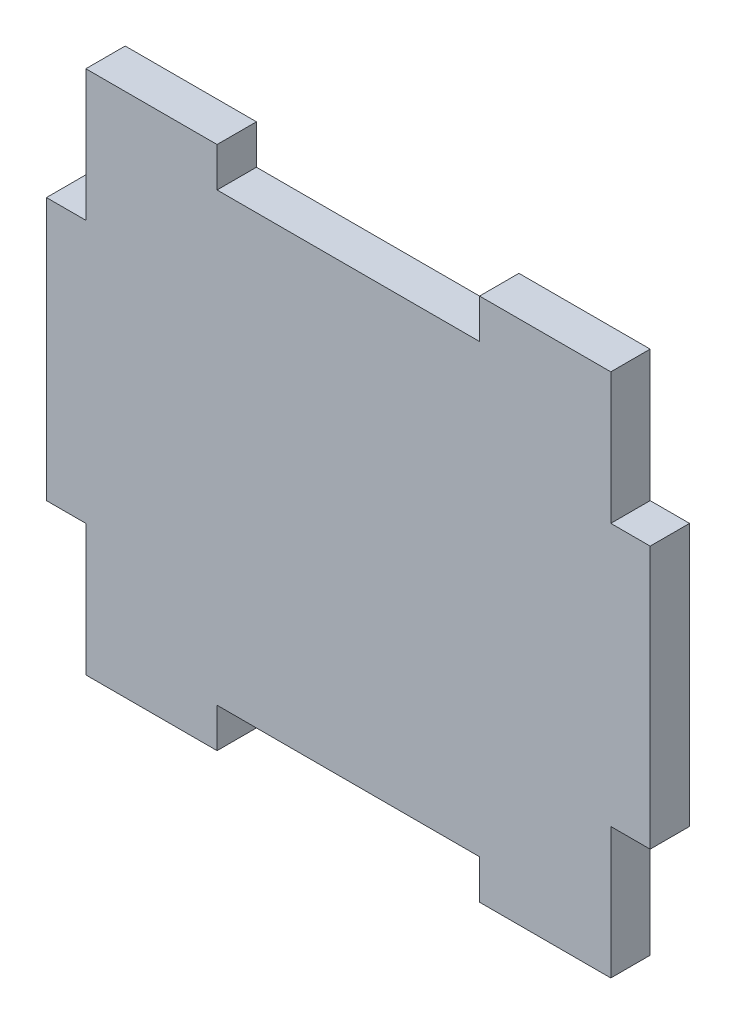
ISO-10303-21;
HEADER;
FILE_DESCRIPTION(('STEP AP214'),'2;1');
FILE_NAME('part.step','',(''),(''),'','','');
FILE_SCHEMA(('AUTOMOTIVE_DESIGN { 1 0 10303 214 1 1 1 1 }'));
ENDSEC;
DATA;
#1=APPLICATION_CONTEXT('core data for automotive mechanical design processes');
#2=APPLICATION_PROTOCOL_DEFINITION('international standard','automotive_design',2000,#1);
#3=PRODUCT_CONTEXT('',#1,'mechanical');
#4=PRODUCT('Part','Part','',(#3));
#5=PRODUCT_RELATED_PRODUCT_CATEGORY('part','',(#4));
#6=PRODUCT_DEFINITION_FORMATION('','',#4);
#7=PRODUCT_DEFINITION_CONTEXT('part definition',#1,'design');
#8=PRODUCT_DEFINITION('design','',#6,#7);
#9=PRODUCT_DEFINITION_SHAPE('','',#8);
#10=(LENGTH_UNIT() NAMED_UNIT(*) SI_UNIT(.MILLI.,.METRE.));
#11=(NAMED_UNIT(*) PLANE_ANGLE_UNIT() SI_UNIT($,.RADIAN.));
#12=(NAMED_UNIT(*) SI_UNIT($,.STERADIAN.) SOLID_ANGLE_UNIT());
#13=UNCERTAINTY_MEASURE_WITH_UNIT(LENGTH_MEASURE(1.E-05),#10,'distance_accuracy_value','');
#14=(GEOMETRIC_REPRESENTATION_CONTEXT(3) GLOBAL_UNCERTAINTY_ASSIGNED_CONTEXT((#13)) GLOBAL_UNIT_ASSIGNED_CONTEXT((#10,
#11,#12)) REPRESENTATION_CONTEXT('',''));
#15=CARTESIAN_POINT('',(0.,0.,0.));
#16=DIRECTION('',(0.,0.,1.));
#17=DIRECTION('',(1.,0.,0.));
#18=AXIS2_PLACEMENT_3D('',#15,#16,#17);
#19=CARTESIAN_POINT('',(-18.9001151198961,-19.1510349441131,3.));
#20=DIRECTION('',(0.,1.,0.));
#21=DIRECTION('',(-1.,0.,0.));
#22=AXIS2_PLACEMENT_3D('',#19,#20,#21);
#23=PLANE('',#22);
#24=DIRECTION('',(1.,0.,0.));
#25=VECTOR('',#24,1.);
#26=CARTESIAN_POINT('',(-18.9001151198961,-19.1510349441131,0.));
#27=LINE('',#26,#25);
#28=CARTESIAN_POINT('',(-18.9001151198961,-19.1510349441131,0.));
#29=VERTEX_POINT('',#28);
#30=CARTESIAN_POINT('',(-8.90011511989615,-19.1510349441131,0.));
#31=VERTEX_POINT('',#30);
#32=EDGE_CURVE('E276',#29,#31,#27,.T.);
#33=ORIENTED_EDGE('',*,*,#32,.T.);
#34=DIRECTION('',(0.,0.,1.));
#35=VECTOR('',#34,1.);
#36=CARTESIAN_POINT('',(-8.90011511989615,-19.1510349441131,0.));
#37=LINE('',#36,#35);
#38=CARTESIAN_POINT('',(-8.90011511989615,-19.1510349441131,3.));
#39=VERTEX_POINT('',#38);
#40=EDGE_CURVE('E218',#31,#39,#37,.T.);
#41=ORIENTED_EDGE('',*,*,#40,.T.);
#42=DIRECTION('',(1.,0.,0.));
#43=VECTOR('',#42,1.);
#44=CARTESIAN_POINT('',(-18.9001151198961,-19.1510349441131,3.));
#45=LINE('',#44,#43);
#46=CARTESIAN_POINT('',(-18.9001151198961,-19.1510349441131,3.));
#47=VERTEX_POINT('',#46);
#48=EDGE_CURVE('E247',#47,#39,#45,.T.);
#49=ORIENTED_EDGE('',*,*,#48,.F.);
#50=DIRECTION('',(0.,0.,-1.));
#51=VECTOR('',#50,1.);
#52=CARTESIAN_POINT('',(-18.9001151198961,-19.1510349441131,3.));
#53=LINE('',#52,#51);
#54=EDGE_CURVE('E311',#47,#29,#53,.T.);
#55=ORIENTED_EDGE('',*,*,#54,.T.);
#56=EDGE_LOOP('',(#33,#41,#49,#55));
#57=FACE_BOUND('',#56,.T.);
#58=ADVANCED_FACE('F37',(#57),#23,.F.);
#59=CARTESIAN_POINT('',(-18.9001151198962,20.8489650558869,3.));
#60=DIRECTION('',(0.,-1.,0.));
#61=DIRECTION('',(0.,0.,-1.));
#62=AXIS2_PLACEMENT_3D('',#59,#60,#61);
#63=PLANE('',#62);
#64=DIRECTION('',(-1.,0.,0.));
#65=VECTOR('',#64,1.);
#66=CARTESIAN_POINT('',(-18.9001151198962,20.8489650558869,3.));
#67=LINE('',#66,#65);
#68=CARTESIAN_POINT('',(-8.90011511989617,20.8489650558869,3.));
#69=VERTEX_POINT('',#68);
#70=CARTESIAN_POINT('',(-18.9001151198962,20.8489650558869,3.));
#71=VERTEX_POINT('',#70);
#72=EDGE_CURVE('E260',#69,#71,#67,.T.);
#73=ORIENTED_EDGE('',*,*,#72,.F.);
#74=DIRECTION('',(0.,0.,1.));
#75=VECTOR('',#74,1.);
#76=CARTESIAN_POINT('',(-8.90011511989617,20.8489650558869,0.));
#77=LINE('',#76,#75);
#78=CARTESIAN_POINT('',(-8.90011511989617,20.8489650558869,0.));
#79=VERTEX_POINT('',#78);
#80=EDGE_CURVE('E204',#79,#69,#77,.T.);
#81=ORIENTED_EDGE('',*,*,#80,.F.);
#82=DIRECTION('',(-1.,0.,0.));
#83=VECTOR('',#82,1.);
#84=CARTESIAN_POINT('',(-18.9001151198962,20.8489650558869,0.));
#85=LINE('',#84,#83);
#86=CARTESIAN_POINT('',(-18.9001151198962,20.8489650558869,0.));
#87=VERTEX_POINT('',#86);
#88=EDGE_CURVE('E194',#79,#87,#85,.T.);
#89=ORIENTED_EDGE('',*,*,#88,.T.);
#90=DIRECTION('',(0.,0.,-1.));
#91=VECTOR('',#90,1.);
#92=CARTESIAN_POINT('',(-18.9001151198962,20.8489650558869,3.));
#93=LINE('',#92,#91);
#94=EDGE_CURVE('E264',#71,#87,#93,.T.);
#95=ORIENTED_EDGE('',*,*,#94,.F.);
#96=EDGE_LOOP('',(#73,#81,#89,#95));
#97=FACE_BOUND('',#96,.T.);
#98=ADVANCED_FACE('F349',(#97),#63,.F.);
#99=CARTESIAN_POINT('',(-18.9001151198962,10.8489650558869,3.));
#100=DIRECTION('',(1.,0.,0.));
#101=DIRECTION('',(0.,1.,0.));
#102=AXIS2_PLACEMENT_3D('',#99,#100,#101);
#103=PLANE('',#102);
#104=DIRECTION('',(0.,-1.,0.));
#105=VECTOR('',#104,1.);
#106=CARTESIAN_POINT('',(-18.9001151198962,10.8489650558869,0.));
#107=LINE('',#106,#105);
#108=CARTESIAN_POINT('',(-18.9001151198962,10.8489650558869,0.));
#109=VERTEX_POINT('',#108);
#110=EDGE_CURVE('E206',#87,#109,#107,.T.);
#111=ORIENTED_EDGE('',*,*,#110,.T.);
#112=DIRECTION('',(0.,0.,-1.));
#113=VECTOR('',#112,1.);
#114=CARTESIAN_POINT('',(-18.9001151198962,10.8489650558869,3.));
#115=LINE('',#114,#113);
#116=CARTESIAN_POINT('',(-18.9001151198962,10.8489650558869,3.));
#117=VERTEX_POINT('',#116);
#118=EDGE_CURVE('E11',#117,#109,#115,.T.);
#119=ORIENTED_EDGE('',*,*,#118,.F.);
#120=DIRECTION('',(0.,-1.,0.));
#121=VECTOR('',#120,1.);
#122=CARTESIAN_POINT('',(-18.9001151198962,10.8489650558869,3.));
#123=LINE('',#122,#121);
#124=EDGE_CURVE('E234',#71,#117,#123,.T.);
#125=ORIENTED_EDGE('',*,*,#124,.F.);
#126=ORIENTED_EDGE('',*,*,#94,.T.);
#127=EDGE_LOOP('',(#111,#119,#125,#126));
#128=FACE_BOUND('',#127,.T.);
#129=ADVANCED_FACE('F39',(#128),#103,.F.);
#130=CARTESIAN_POINT('',(-18.9001151198962,10.8489650558869,3.));
#131=DIRECTION('',(0.,-1.,0.));
#132=DIRECTION('',(0.,0.,-1.));
#133=AXIS2_PLACEMENT_3D('',#130,#131,#132);
#134=PLANE('',#133);
#135=DIRECTION('',(-1.,0.,0.));
#136=VECTOR('',#135,1.);
#137=CARTESIAN_POINT('',(-18.9001151198962,10.8489650558869,0.));
#138=LINE('',#137,#136);
#139=CARTESIAN_POINT('',(-21.9001151198962,10.8489650558869,0.));
#140=VERTEX_POINT('',#139);
#141=EDGE_CURVE('E267',#109,#140,#138,.T.);
#142=ORIENTED_EDGE('',*,*,#141,.T.);
#143=DIRECTION('',(0.,0.,-1.));
#144=VECTOR('',#143,1.);
#145=CARTESIAN_POINT('',(-21.9001151198962,10.8489650558869,3.));
#146=LINE('',#145,#144);
#147=CARTESIAN_POINT('',(-21.9001151198962,10.8489650558869,3.));
#148=VERTEX_POINT('',#147);
#149=EDGE_CURVE('E45',#148,#140,#146,.T.);
#150=ORIENTED_EDGE('',*,*,#149,.F.);
#151=DIRECTION('',(-1.,0.,0.));
#152=VECTOR('',#151,1.);
#153=CARTESIAN_POINT('',(-18.9001151198962,10.8489650558869,3.));
#154=LINE('',#153,#152);
#155=EDGE_CURVE('E237',#117,#148,#154,.T.);
#156=ORIENTED_EDGE('',*,*,#155,.F.);
#157=ORIENTED_EDGE('',*,*,#118,.T.);
#158=EDGE_LOOP('',(#142,#150,#156,#157));
#159=FACE_BOUND('',#158,.T.);
#160=ADVANCED_FACE('F344',(#159),#134,.F.);
#161=CARTESIAN_POINT('',(-21.9001151198962,10.8489650558869,3.));
#162=DIRECTION('',(1.,0.,0.));
#163=DIRECTION('',(0.,1.,0.));
#164=AXIS2_PLACEMENT_3D('',#161,#162,#163);
#165=PLANE('',#164);
#166=DIRECTION('',(0.,-1.,0.));
#167=VECTOR('',#166,1.);
#168=CARTESIAN_POINT('',(-21.9001151198962,10.8489650558869,0.));
#169=LINE('',#168,#167);
#170=CARTESIAN_POINT('',(-21.9001151198962,-9.15103494411314,0.));
#171=VERTEX_POINT('',#170);
#172=EDGE_CURVE('E269',#140,#171,#169,.T.);
#173=ORIENTED_EDGE('',*,*,#172,.T.);
#174=DIRECTION('',(0.,0.,-1.));
#175=VECTOR('',#174,1.);
#176=CARTESIAN_POINT('',(-21.9001151198962,-9.15103494411314,3.));
#177=LINE('',#176,#175);
#178=CARTESIAN_POINT('',(-21.9001151198962,-9.15103494411314,3.));
#179=VERTEX_POINT('',#178);
#180=EDGE_CURVE('E317',#179,#171,#177,.T.);
#181=ORIENTED_EDGE('',*,*,#180,.F.);
#182=DIRECTION('',(0.,-1.,0.));
#183=VECTOR('',#182,1.);
#184=CARTESIAN_POINT('',(-21.9001151198962,10.8489650558869,3.));
#185=LINE('',#184,#183);
#186=EDGE_CURVE('E240',#148,#179,#185,.T.);
#187=ORIENTED_EDGE('',*,*,#186,.F.);
#188=ORIENTED_EDGE('',*,*,#149,.T.);
#189=EDGE_LOOP('',(#173,#181,#187,#188));
#190=FACE_BOUND('',#189,.T.);
#191=ADVANCED_FACE('F324',(#190),#165,.F.);
#192=CARTESIAN_POINT('',(-18.9001151198962,-9.15103494411314,3.));
#193=DIRECTION('',(0.,1.,0.));
#194=DIRECTION('',(0.,0.,1.));
#195=AXIS2_PLACEMENT_3D('',#192,#193,#194);
#196=PLANE('',#195);
#197=DIRECTION('',(1.,0.,0.));
#198=VECTOR('',#197,1.);
#199=CARTESIAN_POINT('',(-18.9001151198962,-9.15103494411314,0.));
#200=LINE('',#199,#198);
#201=CARTESIAN_POINT('',(-18.9001151198962,-9.15103494411314,0.));
#202=VERTEX_POINT('',#201);
#203=EDGE_CURVE('E271',#171,#202,#200,.T.);
#204=ORIENTED_EDGE('',*,*,#203,.T.);
#205=DIRECTION('',(0.,0.,-1.));
#206=VECTOR('',#205,1.);
#207=CARTESIAN_POINT('',(-18.9001151198962,-9.15103494411314,3.));
#208=LINE('',#207,#206);
#209=CARTESIAN_POINT('',(-18.9001151198962,-9.15103494411314,3.));
#210=VERTEX_POINT('',#209);
#211=EDGE_CURVE('E314',#210,#202,#208,.T.);
#212=ORIENTED_EDGE('',*,*,#211,.F.);
#213=DIRECTION('',(1.,0.,0.));
#214=VECTOR('',#213,1.);
#215=CARTESIAN_POINT('',(-18.9001151198962,-9.15103494411314,3.));
#216=LINE('',#215,#214);
#217=EDGE_CURVE('E242',#179,#210,#216,.T.);
#218=ORIENTED_EDGE('',*,*,#217,.F.);
#219=ORIENTED_EDGE('',*,*,#180,.T.);
#220=EDGE_LOOP('',(#204,#212,#218,#219));
#221=FACE_BOUND('',#220,.T.);
#222=ADVANCED_FACE('F332',(#221),#196,.F.);
#223=CARTESIAN_POINT('',(-18.9001151198962,-9.15103494411314,3.));
#224=DIRECTION('',(1.,0.,0.));
#225=DIRECTION('',(0.,1.,0.));
#226=AXIS2_PLACEMENT_3D('',#223,#224,#225);
#227=PLANE('',#226);
#228=DIRECTION('',(0.,-1.,0.));
#229=VECTOR('',#228,1.);
#230=CARTESIAN_POINT('',(-18.9001151198962,-9.15103494411314,0.));
#231=LINE('',#230,#229);
#232=EDGE_CURVE('E273',#202,#29,#231,.T.);
#233=ORIENTED_EDGE('',*,*,#232,.T.);
#234=ORIENTED_EDGE('',*,*,#54,.F.);
#235=DIRECTION('',(0.,-1.,0.));
#236=VECTOR('',#235,1.);
#237=CARTESIAN_POINT('',(-18.9001151198962,-9.15103494411314,3.));
#238=LINE('',#237,#236);
#239=EDGE_CURVE('E244',#210,#47,#238,.T.);
#240=ORIENTED_EDGE('',*,*,#239,.F.);
#241=ORIENTED_EDGE('',*,*,#211,.T.);
#242=EDGE_LOOP('',(#233,#234,#240,#241));
#243=FACE_BOUND('',#242,.T.);
#244=ADVANCED_FACE('F336',(#243),#227,.F.);
#245=CARTESIAN_POINT('',(11.0998848801038,-19.1510349441131,3.));
#246=VERTEX_POINT('',#245);
#247=CARTESIAN_POINT('',(21.0998848801039,-19.1510349441131,3.));
#248=VERTEX_POINT('',#247);
#249=EDGE_CURVE('E246',#246,#248,#45,.T.);
#250=ORIENTED_EDGE('',*,*,#249,.F.);
#251=DIRECTION('',(0.,0.,1.));
#252=VECTOR('',#251,1.);
#253=CARTESIAN_POINT('',(11.0998848801038,-19.1510349441131,0.));
#254=LINE('',#253,#252);
#255=CARTESIAN_POINT('',(11.0998848801038,-19.1510349441131,0.));
#256=VERTEX_POINT('',#255);
#257=EDGE_CURVE('E211',#256,#246,#254,.T.);
#258=ORIENTED_EDGE('',*,*,#257,.F.);
#259=CARTESIAN_POINT('',(21.0998848801039,-19.1510349441131,0.));
#260=VERTEX_POINT('',#259);
#261=EDGE_CURVE('E275',#256,#260,#27,.T.);
#262=ORIENTED_EDGE('',*,*,#261,.T.);
#263=DIRECTION('',(0.,0.,-1.));
#264=VECTOR('',#263,1.);
#265=CARTESIAN_POINT('',(21.0998848801039,-19.1510349441131,3.));
#266=LINE('',#265,#264);
#267=EDGE_CURVE('E308',#248,#260,#266,.T.);
#268=ORIENTED_EDGE('',*,*,#267,.F.);
#269=EDGE_LOOP('',(#250,#258,#262,#268));
#270=FACE_BOUND('',#269,.T.);
#271=ADVANCED_FACE('F385',(#270),#23,.F.);
#272=CARTESIAN_POINT('',(21.0998848801038,-9.15103494411312,3.));
#273=DIRECTION('',(-1.,0.,0.));
#274=DIRECTION('',(0.,-1.,0.));
#275=AXIS2_PLACEMENT_3D('',#272,#273,#274);
#276=PLANE('',#275);
#277=DIRECTION('',(0.,1.,0.));
#278=VECTOR('',#277,1.);
#279=CARTESIAN_POINT('',(21.0998848801038,-9.15103494411312,0.));
#280=LINE('',#279,#278);
#281=CARTESIAN_POINT('',(21.0998848801038,-9.15103494411312,0.));
#282=VERTEX_POINT('',#281);
#283=EDGE_CURVE('E279',#260,#282,#280,.T.);
#284=ORIENTED_EDGE('',*,*,#283,.T.);
#285=DIRECTION('',(0.,0.,-1.));
#286=VECTOR('',#285,1.);
#287=CARTESIAN_POINT('',(21.0998848801038,-9.15103494411312,3.));
#288=LINE('',#287,#286);
#289=CARTESIAN_POINT('',(21.0998848801038,-9.15103494411312,3.));
#290=VERTEX_POINT('',#289);
#291=EDGE_CURVE('E305',#290,#282,#288,.T.);
#292=ORIENTED_EDGE('',*,*,#291,.F.);
#293=DIRECTION('',(0.,1.,0.));
#294=VECTOR('',#293,1.);
#295=CARTESIAN_POINT('',(21.0998848801038,-9.15103494411312,3.));
#296=LINE('',#295,#294);
#297=EDGE_CURVE('E250',#248,#290,#296,.T.);
#298=ORIENTED_EDGE('',*,*,#297,.F.);
#299=ORIENTED_EDGE('',*,*,#267,.T.);
#300=EDGE_LOOP('',(#284,#292,#298,#299));
#301=FACE_BOUND('',#300,.T.);
#302=ADVANCED_FACE('F381',(#301),#276,.F.);
#303=CARTESIAN_POINT('',(21.0998848801038,-9.15103494411312,3.));
#304=DIRECTION('',(0.,1.,0.));
#305=DIRECTION('',(0.,0.,1.));
#306=AXIS2_PLACEMENT_3D('',#303,#304,#305);
#307=PLANE('',#306);
#308=DIRECTION('',(1.,0.,0.));
#309=VECTOR('',#308,1.);
#310=CARTESIAN_POINT('',(21.0998848801038,-9.15103494411312,0.));
#311=LINE('',#310,#309);
#312=CARTESIAN_POINT('',(24.0998848801038,-9.15103494411312,0.));
#313=VERTEX_POINT('',#312);
#314=EDGE_CURVE('E281',#282,#313,#311,.T.);
#315=ORIENTED_EDGE('',*,*,#314,.T.);
#316=DIRECTION('',(0.,0.,-1.));
#317=VECTOR('',#316,1.);
#318=CARTESIAN_POINT('',(24.0998848801038,-9.15103494411312,3.));
#319=LINE('',#318,#317);
#320=CARTESIAN_POINT('',(24.0998848801038,-9.15103494411312,3.));
#321=VERTEX_POINT('',#320);
#322=EDGE_CURVE('E302',#321,#313,#319,.T.);
#323=ORIENTED_EDGE('',*,*,#322,.F.);
#324=DIRECTION('',(1.,0.,0.));
#325=VECTOR('',#324,1.);
#326=CARTESIAN_POINT('',(21.0998848801038,-9.15103494411312,3.));
#327=LINE('',#326,#325);
#328=EDGE_CURVE('E252',#290,#321,#327,.T.);
#329=ORIENTED_EDGE('',*,*,#328,.F.);
#330=ORIENTED_EDGE('',*,*,#291,.T.);
#331=EDGE_LOOP('',(#315,#323,#329,#330));
#332=FACE_BOUND('',#331,.T.);
#333=ADVANCED_FACE('F376',(#332),#307,.F.);
#334=CARTESIAN_POINT('',(24.0998848801038,10.8489650558869,3.));
#335=DIRECTION('',(-1.,0.,0.));
#336=DIRECTION('',(0.,-1.,0.));
#337=AXIS2_PLACEMENT_3D('',#334,#335,#336);
#338=PLANE('',#337);
#339=DIRECTION('',(0.,1.,0.));
#340=VECTOR('',#339,1.);
#341=CARTESIAN_POINT('',(24.0998848801038,10.8489650558869,0.));
#342=LINE('',#341,#340);
#343=CARTESIAN_POINT('',(24.0998848801038,10.8489650558869,0.));
#344=VERTEX_POINT('',#343);
#345=EDGE_CURVE('E283',#313,#344,#342,.T.);
#346=ORIENTED_EDGE('',*,*,#345,.T.);
#347=DIRECTION('',(0.,0.,-1.));
#348=VECTOR('',#347,1.);
#349=CARTESIAN_POINT('',(24.0998848801038,10.8489650558869,3.));
#350=LINE('',#349,#348);
#351=CARTESIAN_POINT('',(24.0998848801038,10.8489650558869,3.));
#352=VERTEX_POINT('',#351);
#353=EDGE_CURVE('E299',#352,#344,#350,.T.);
#354=ORIENTED_EDGE('',*,*,#353,.F.);
#355=DIRECTION('',(0.,1.,0.));
#356=VECTOR('',#355,1.);
#357=CARTESIAN_POINT('',(24.0998848801038,10.8489650558869,3.));
#358=LINE('',#357,#356);
#359=EDGE_CURVE('E254',#321,#352,#358,.T.);
#360=ORIENTED_EDGE('',*,*,#359,.F.);
#361=ORIENTED_EDGE('',*,*,#322,.T.);
#362=EDGE_LOOP('',(#346,#354,#360,#361));
#363=FACE_BOUND('',#362,.T.);
#364=ADVANCED_FACE('F370',(#363),#338,.F.);
#365=CARTESIAN_POINT('',(21.0998848801038,10.8489650558869,3.));
#366=DIRECTION('',(0.,-1.,0.));
#367=DIRECTION('',(1.,0.,0.));
#368=AXIS2_PLACEMENT_3D('',#365,#366,#367);
#369=PLANE('',#368);
#370=DIRECTION('',(-1.,0.,0.));
#371=VECTOR('',#370,1.);
#372=CARTESIAN_POINT('',(21.0998848801038,10.8489650558869,0.));
#373=LINE('',#372,#371);
#374=CARTESIAN_POINT('',(21.0998848801038,10.8489650558869,0.));
#375=VERTEX_POINT('',#374);
#376=EDGE_CURVE('E285',#344,#375,#373,.T.);
#377=ORIENTED_EDGE('',*,*,#376,.T.);
#378=DIRECTION('',(0.,0.,-1.));
#379=VECTOR('',#378,1.);
#380=CARTESIAN_POINT('',(21.0998848801038,10.8489650558869,3.));
#381=LINE('',#380,#379);
#382=CARTESIAN_POINT('',(21.0998848801038,10.8489650558869,3.));
#383=VERTEX_POINT('',#382);
#384=EDGE_CURVE('E296',#383,#375,#381,.T.);
#385=ORIENTED_EDGE('',*,*,#384,.F.);
#386=DIRECTION('',(-1.,0.,0.));
#387=VECTOR('',#386,1.);
#388=CARTESIAN_POINT('',(21.0998848801038,10.8489650558869,3.));
#389=LINE('',#388,#387);
#390=EDGE_CURVE('E256',#352,#383,#389,.T.);
#391=ORIENTED_EDGE('',*,*,#390,.F.);
#392=ORIENTED_EDGE('',*,*,#353,.T.);
#393=EDGE_LOOP('',(#377,#385,#391,#392));
#394=FACE_BOUND('',#393,.T.);
#395=ADVANCED_FACE('F366',(#394),#369,.F.);
#396=CARTESIAN_POINT('',(21.0998848801038,20.8489650558869,3.));
#397=DIRECTION('',(-1.,0.,0.));
#398=DIRECTION('',(0.,0.,1.));
#399=AXIS2_PLACEMENT_3D('',#396,#397,#398);
#400=PLANE('',#399);
#401=DIRECTION('',(0.,1.,0.));
#402=VECTOR('',#401,1.);
#403=CARTESIAN_POINT('',(21.0998848801038,20.8489650558869,0.));
#404=LINE('',#403,#402);
#405=CARTESIAN_POINT('',(21.0998848801038,20.8489650558869,0.));
#406=VERTEX_POINT('',#405);
#407=EDGE_CURVE('E287',#375,#406,#404,.T.);
#408=ORIENTED_EDGE('',*,*,#407,.T.);
#409=DIRECTION('',(0.,0.,-1.));
#410=VECTOR('',#409,1.);
#411=CARTESIAN_POINT('',(21.0998848801038,20.8489650558869,3.));
#412=LINE('',#411,#410);
#413=CARTESIAN_POINT('',(21.0998848801038,20.8489650558869,3.));
#414=VERTEX_POINT('',#413);
#415=EDGE_CURVE('E293',#414,#406,#412,.T.);
#416=ORIENTED_EDGE('',*,*,#415,.F.);
#417=DIRECTION('',(0.,1.,0.));
#418=VECTOR('',#417,1.);
#419=CARTESIAN_POINT('',(21.0998848801038,20.8489650558869,3.));
#420=LINE('',#419,#418);
#421=EDGE_CURVE('E258',#383,#414,#420,.T.);
#422=ORIENTED_EDGE('',*,*,#421,.F.);
#423=ORIENTED_EDGE('',*,*,#384,.T.);
#424=EDGE_LOOP('',(#408,#416,#422,#423));
#425=FACE_BOUND('',#424,.T.);
#426=ADVANCED_FACE('F361',(#425),#400,.F.);
#427=CARTESIAN_POINT('',(11.0998848801038,20.8489650558869,0.));
#428=VERTEX_POINT('',#427);
#429=EDGE_CURVE('E238',#406,#428,#85,.T.);
#430=ORIENTED_EDGE('',*,*,#429,.T.);
#431=DIRECTION('',(0.,0.,1.));
#432=VECTOR('',#431,1.);
#433=CARTESIAN_POINT('',(11.0998848801038,20.8489650558869,0.));
#434=LINE('',#433,#432);
#435=CARTESIAN_POINT('',(11.0998848801038,20.8489650558869,3.));
#436=VERTEX_POINT('',#435);
#437=EDGE_CURVE('E207',#428,#436,#434,.T.);
#438=ORIENTED_EDGE('',*,*,#437,.T.);
#439=EDGE_CURVE('E261',#414,#436,#67,.T.);
#440=ORIENTED_EDGE('',*,*,#439,.F.);
#441=ORIENTED_EDGE('',*,*,#415,.T.);
#442=EDGE_LOOP('',(#430,#438,#440,#441));
#443=FACE_BOUND('',#442,.T.);
#444=ADVANCED_FACE('F354',(#443),#63,.F.);
#445=CARTESIAN_POINT('',(0.,0.,3.));
#446=DIRECTION('',(0.,0.,-1.));
#447=DIRECTION('',(-1.,0.,0.));
#448=AXIS2_PLACEMENT_3D('',#445,#446,#447);
#449=PLANE('',#448);
#450=DIRECTION('',(1.,0.,0.));
#451=VECTOR('',#450,1.);
#452=CARTESIAN_POINT('',(-8.90011511989617,17.8489650558869,3.));
#453=LINE('',#452,#451);
#454=CARTESIAN_POINT('',(-8.90011511989617,17.8489650558869,3.));
#455=VERTEX_POINT('',#454);
#456=CARTESIAN_POINT('',(11.0998848801038,17.8489650558869,3.));
#457=VERTEX_POINT('',#456);
#458=EDGE_CURVE('E197',#455,#457,#453,.T.);
#459=ORIENTED_EDGE('',*,*,#458,.F.);
#460=DIRECTION('',(0.,-1.,0.));
#461=VECTOR('',#460,1.);
#462=CARTESIAN_POINT('',(-8.90011511989617,20.8489650558869,3.));
#463=LINE('',#462,#461);
#464=EDGE_CURVE('E180',#69,#455,#463,.T.);
#465=ORIENTED_EDGE('',*,*,#464,.F.);
#466=ORIENTED_EDGE('',*,*,#72,.T.);
#467=ORIENTED_EDGE('',*,*,#124,.T.);
#468=ORIENTED_EDGE('',*,*,#155,.T.);
#469=ORIENTED_EDGE('',*,*,#186,.T.);
#470=ORIENTED_EDGE('',*,*,#217,.T.);
#471=ORIENTED_EDGE('',*,*,#239,.T.);
#472=ORIENTED_EDGE('',*,*,#48,.T.);
#473=DIRECTION('',(0.,-1.,0.));
#474=VECTOR('',#473,1.);
#475=CARTESIAN_POINT('',(-8.90011511989615,-19.1510349441131,3.));
#476=LINE('',#475,#474);
#477=CARTESIAN_POINT('',(-8.90011511989615,-16.1510349441131,3.));
#478=VERTEX_POINT('',#477);
#479=EDGE_CURVE('E221',#478,#39,#476,.T.);
#480=ORIENTED_EDGE('',*,*,#479,.F.);
#481=DIRECTION('',(-1.,0.,0.));
#482=VECTOR('',#481,1.);
#483=CARTESIAN_POINT('',(-8.90011511989615,-16.1510349441131,3.));
#484=LINE('',#483,#482);
#485=CARTESIAN_POINT('',(11.0998848801038,-16.1510349441131,3.));
#486=VERTEX_POINT('',#485);
#487=EDGE_CURVE('E223',#486,#478,#484,.T.);
#488=ORIENTED_EDGE('',*,*,#487,.F.);
#489=DIRECTION('',(0.,1.,0.));
#490=VECTOR('',#489,1.);
#491=CARTESIAN_POINT('',(11.0998848801038,-19.1510349441131,3.));
#492=LINE('',#491,#490);
#493=EDGE_CURVE('E202',#246,#486,#492,.T.);
#494=ORIENTED_EDGE('',*,*,#493,.F.);
#495=ORIENTED_EDGE('',*,*,#249,.T.);
#496=ORIENTED_EDGE('',*,*,#297,.T.);
#497=ORIENTED_EDGE('',*,*,#328,.T.);
#498=ORIENTED_EDGE('',*,*,#359,.T.);
#499=ORIENTED_EDGE('',*,*,#390,.T.);
#500=ORIENTED_EDGE('',*,*,#421,.T.);
#501=ORIENTED_EDGE('',*,*,#439,.T.);
#502=DIRECTION('',(0.,1.,0.));
#503=VECTOR('',#502,1.);
#504=CARTESIAN_POINT('',(11.0998848801038,20.8489650558869,3.));
#505=LINE('',#504,#503);
#506=EDGE_CURVE('E195',#457,#436,#505,.T.);
#507=ORIENTED_EDGE('',*,*,#506,.F.);
#508=EDGE_LOOP('',(#459,#465,#466,#467,#468,#469,#470,#471,#472,#480,#488,#494,#495,#496,#497,
#498,#499,#500,#501,#507));
#509=FACE_BOUND('',#508,.T.);
#510=ADVANCED_FACE('F340',(#509),#449,.F.);
#511=CARTESIAN_POINT('',(0.,0.,0.));
#512=DIRECTION('',(0.,0.,-1.));
#513=DIRECTION('',(-1.,0.,0.));
#514=AXIS2_PLACEMENT_3D('',#511,#512,#513);
#515=PLANE('',#514);
#516=DIRECTION('',(0.,-1.,0.));
#517=VECTOR('',#516,1.);
#518=CARTESIAN_POINT('',(-8.90011511989617,20.8489650558869,0.));
#519=LINE('',#518,#517);
#520=CARTESIAN_POINT('',(-8.90011511989617,17.8489650558869,0.));
#521=VERTEX_POINT('',#520);
#522=EDGE_CURVE('E177',#79,#521,#519,.T.);
#523=ORIENTED_EDGE('',*,*,#522,.T.);
#524=DIRECTION('',(1.,0.,0.));
#525=VECTOR('',#524,1.);
#526=CARTESIAN_POINT('',(-8.90011511989617,17.8489650558869,0.));
#527=LINE('',#526,#525);
#528=CARTESIAN_POINT('',(11.0998848801038,17.8489650558869,0.));
#529=VERTEX_POINT('',#528);
#530=EDGE_CURVE('E187',#521,#529,#527,.T.);
#531=ORIENTED_EDGE('',*,*,#530,.T.);
#532=DIRECTION('',(0.,1.,0.));
#533=VECTOR('',#532,1.);
#534=CARTESIAN_POINT('',(11.0998848801038,20.8489650558869,0.));
#535=LINE('',#534,#533);
#536=EDGE_CURVE('E52',#529,#428,#535,.T.);
#537=ORIENTED_EDGE('',*,*,#536,.T.);
#538=ORIENTED_EDGE('',*,*,#429,.F.);
#539=ORIENTED_EDGE('',*,*,#407,.F.);
#540=ORIENTED_EDGE('',*,*,#376,.F.);
#541=ORIENTED_EDGE('',*,*,#345,.F.);
#542=ORIENTED_EDGE('',*,*,#314,.F.);
#543=ORIENTED_EDGE('',*,*,#283,.F.);
#544=ORIENTED_EDGE('',*,*,#261,.F.);
#545=DIRECTION('',(0.,1.,0.));
#546=VECTOR('',#545,1.);
#547=CARTESIAN_POINT('',(11.0998848801038,-19.1510349441131,0.));
#548=LINE('',#547,#546);
#549=CARTESIAN_POINT('',(11.0998848801038,-16.1510349441131,0.));
#550=VERTEX_POINT('',#549);
#551=EDGE_CURVE('E224',#256,#550,#548,.T.);
#552=ORIENTED_EDGE('',*,*,#551,.T.);
#553=DIRECTION('',(-1.,0.,0.));
#554=VECTOR('',#553,1.);
#555=CARTESIAN_POINT('',(-8.90011511989615,-16.1510349441131,0.));
#556=LINE('',#555,#554);
#557=CARTESIAN_POINT('',(-8.90011511989615,-16.1510349441131,0.));
#558=VERTEX_POINT('',#557);
#559=EDGE_CURVE('E60',#550,#558,#556,.T.);
#560=ORIENTED_EDGE('',*,*,#559,.T.);
#561=DIRECTION('',(0.,-1.,0.));
#562=VECTOR('',#561,1.);
#563=CARTESIAN_POINT('',(-8.90011511989615,-19.1510349441131,0.));
#564=LINE('',#563,#562);
#565=EDGE_CURVE('E213',#558,#31,#564,.T.);
#566=ORIENTED_EDGE('',*,*,#565,.T.);
#567=ORIENTED_EDGE('',*,*,#32,.F.);
#568=ORIENTED_EDGE('',*,*,#232,.F.);
#569=ORIENTED_EDGE('',*,*,#203,.F.);
#570=ORIENTED_EDGE('',*,*,#172,.F.);
#571=ORIENTED_EDGE('',*,*,#141,.F.);
#572=ORIENTED_EDGE('',*,*,#110,.F.);
#573=ORIENTED_EDGE('',*,*,#88,.F.);
#574=EDGE_LOOP('',(#523,#531,#537,#538,#539,#540,#541,#542,#543,#544,#552,#560,#566,#567,#568,
#569,#570,#571,#572,#573));
#575=FACE_BOUND('',#574,.T.);
#576=ADVANCED_FACE('F192',(#575),#515,.T.);
#577=CARTESIAN_POINT('',(-8.90011511989615,-19.1510349441131,0.));
#578=DIRECTION('',(-1.,0.,0.));
#579=DIRECTION('',(0.,-1.,0.));
#580=AXIS2_PLACEMENT_3D('',#577,#578,#579);
#581=PLANE('',#580);
#582=ORIENTED_EDGE('',*,*,#479,.T.);
#583=ORIENTED_EDGE('',*,*,#40,.F.);
#584=ORIENTED_EDGE('',*,*,#565,.F.);
#585=DIRECTION('',(0.,0.,1.));
#586=VECTOR('',#585,1.);
#587=CARTESIAN_POINT('',(-8.90011511989615,-16.1510349441131,0.));
#588=LINE('',#587,#586);
#589=EDGE_CURVE('E216',#558,#478,#588,.T.);
#590=ORIENTED_EDGE('',*,*,#589,.T.);
#591=EDGE_LOOP('',(#582,#583,#584,#590));
#592=FACE_BOUND('',#591,.T.);
#593=ADVANCED_FACE('F394',(#592),#581,.F.);
#594=CARTESIAN_POINT('',(-8.90011511989615,-16.1510349441131,0.));
#595=DIRECTION('',(0.,1.,0.));
#596=DIRECTION('',(-1.,0.,0.));
#597=AXIS2_PLACEMENT_3D('',#594,#595,#596);
#598=PLANE('',#597);
#599=ORIENTED_EDGE('',*,*,#487,.T.);
#600=ORIENTED_EDGE('',*,*,#589,.F.);
#601=ORIENTED_EDGE('',*,*,#559,.F.);
#602=DIRECTION('',(0.,0.,1.));
#603=VECTOR('',#602,1.);
#604=CARTESIAN_POINT('',(11.0998848801038,-16.1510349441131,0.));
#605=LINE('',#604,#603);
#606=EDGE_CURVE('E214',#550,#486,#605,.T.);
#607=ORIENTED_EDGE('',*,*,#606,.T.);
#608=EDGE_LOOP('',(#599,#600,#601,#607));
#609=FACE_BOUND('',#608,.T.);
#610=ADVANCED_FACE('F391',(#609),#598,.F.);
#611=CARTESIAN_POINT('',(11.0998848801038,-19.1510349441131,0.));
#612=DIRECTION('',(1.,0.,0.));
#613=DIRECTION('',(0.,0.,-1.));
#614=AXIS2_PLACEMENT_3D('',#611,#612,#613);
#615=PLANE('',#614);
#616=ORIENTED_EDGE('',*,*,#493,.T.);
#617=ORIENTED_EDGE('',*,*,#606,.F.);
#618=ORIENTED_EDGE('',*,*,#551,.F.);
#619=ORIENTED_EDGE('',*,*,#257,.T.);
#620=EDGE_LOOP('',(#616,#617,#618,#619));
#621=FACE_BOUND('',#620,.T.);
#622=ADVANCED_FACE('F388',(#621),#615,.F.);
#623=CARTESIAN_POINT('',(-8.90011511989617,20.8489650558869,0.));
#624=DIRECTION('',(-1.,0.,0.));
#625=DIRECTION('',(0.,0.,1.));
#626=AXIS2_PLACEMENT_3D('',#623,#624,#625);
#627=PLANE('',#626);
#628=ORIENTED_EDGE('',*,*,#464,.T.);
#629=DIRECTION('',(0.,0.,1.));
#630=VECTOR('',#629,1.);
#631=CARTESIAN_POINT('',(-8.90011511989617,17.8489650558869,0.));
#632=LINE('',#631,#630);
#633=EDGE_CURVE('E173',#521,#455,#632,.T.);
#634=ORIENTED_EDGE('',*,*,#633,.F.);
#635=ORIENTED_EDGE('',*,*,#522,.F.);
#636=ORIENTED_EDGE('',*,*,#80,.T.);
#637=EDGE_LOOP('',(#628,#634,#635,#636));
#638=FACE_BOUND('',#637,.T.);
#639=ADVANCED_FACE('F175',(#638),#627,.F.);
#640=CARTESIAN_POINT('',(11.0998848801038,20.8489650558869,0.));
#641=DIRECTION('',(1.,0.,0.));
#642=DIRECTION('',(0.,0.,-1.));
#643=AXIS2_PLACEMENT_3D('',#640,#641,#642);
#644=PLANE('',#643);
#645=ORIENTED_EDGE('',*,*,#506,.T.);
#646=ORIENTED_EDGE('',*,*,#437,.F.);
#647=ORIENTED_EDGE('',*,*,#536,.F.);
#648=DIRECTION('',(0.,0.,1.));
#649=VECTOR('',#648,1.);
#650=CARTESIAN_POINT('',(11.0998848801038,17.8489650558869,0.));
#651=LINE('',#650,#649);
#652=EDGE_CURVE('E184',#529,#457,#651,.T.);
#653=ORIENTED_EDGE('',*,*,#652,.T.);
#654=EDGE_LOOP('',(#645,#646,#647,#653));
#655=FACE_BOUND('',#654,.T.);
#656=ADVANCED_FACE('F352',(#655),#644,.F.);
#657=CARTESIAN_POINT('',(-8.90011511989617,17.8489650558869,0.));
#658=DIRECTION('',(0.,-1.,0.));
#659=DIRECTION('',(1.,0.,0.));
#660=AXIS2_PLACEMENT_3D('',#657,#658,#659);
#661=PLANE('',#660);
#662=ORIENTED_EDGE('',*,*,#458,.T.);
#663=ORIENTED_EDGE('',*,*,#652,.F.);
#664=ORIENTED_EDGE('',*,*,#530,.F.);
#665=ORIENTED_EDGE('',*,*,#633,.T.);
#666=EDGE_LOOP('',(#662,#663,#664,#665));
#667=FACE_BOUND('',#666,.T.);
#668=ADVANCED_FACE('F188',(#667),#661,.F.);
#669=CLOSED_SHELL('',(#58,#98,#129,#160,#191,#222,#244,#271,#302,#333,#364,#395,#426,#444,#510,
#576,#593,#610,#622,#639,#656,#668));
#670=MANIFOLD_SOLID_BREP('B2',#669);
#671=ADVANCED_BREP_SHAPE_REPRESENTATION('',(#18,#670),#14);
#672=SHAPE_DEFINITION_REPRESENTATION(#9,#671);
ENDSEC;
END-ISO-10303-21;
